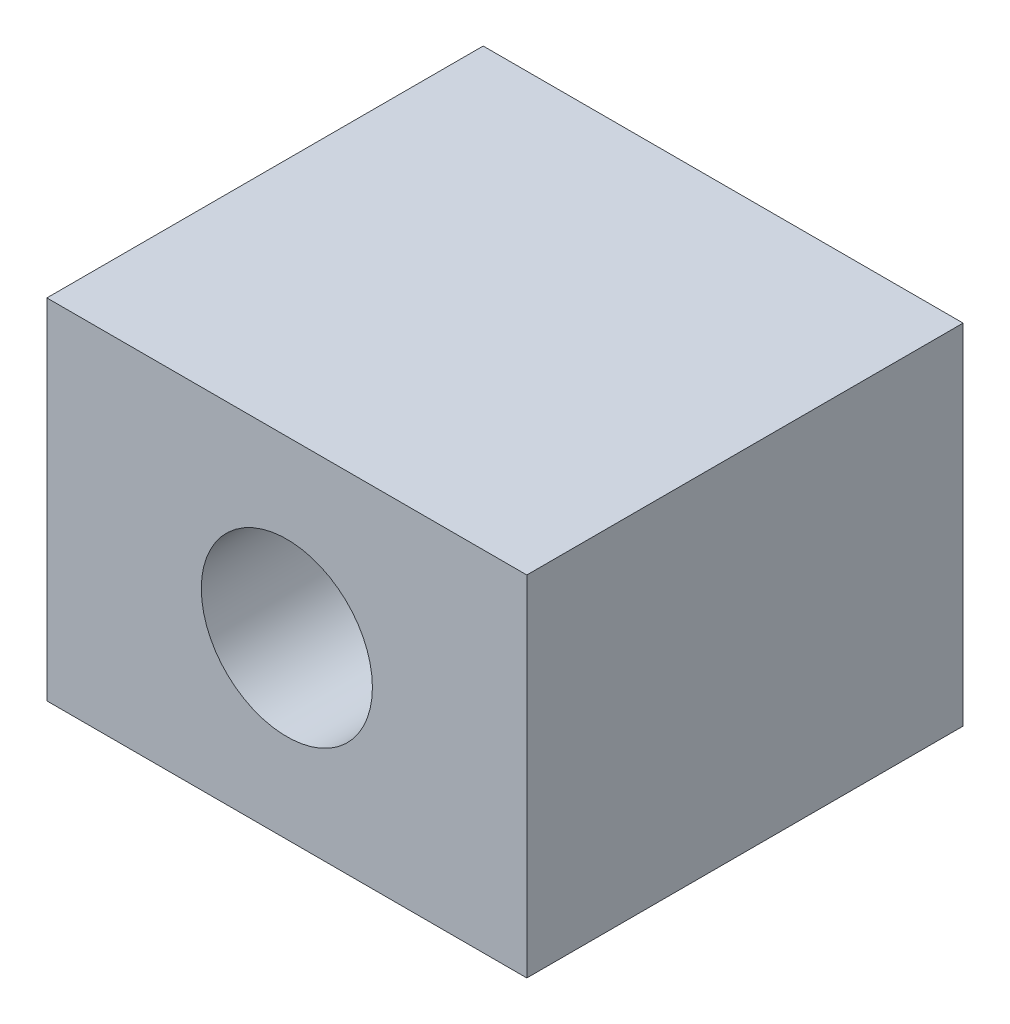
ISO-10303-21;
HEADER;
FILE_DESCRIPTION(('STEP AP214'),'2;1');
FILE_NAME('part.step','',(''),(''),'','','');
FILE_SCHEMA(('AUTOMOTIVE_DESIGN { 1 0 10303 214 1 1 1 1 }'));
ENDSEC;
DATA;
#1=APPLICATION_CONTEXT('core data for automotive mechanical design processes');
#2=APPLICATION_PROTOCOL_DEFINITION('international standard','automotive_design',2000,#1);
#3=PRODUCT_CONTEXT('',#1,'mechanical');
#4=PRODUCT('Part','Part','',(#3));
#5=PRODUCT_RELATED_PRODUCT_CATEGORY('part','',(#4));
#6=PRODUCT_DEFINITION_FORMATION('','',#4);
#7=PRODUCT_DEFINITION_CONTEXT('part definition',#1,'design');
#8=PRODUCT_DEFINITION('design','',#6,#7);
#9=PRODUCT_DEFINITION_SHAPE('','',#8);
#10=(LENGTH_UNIT() NAMED_UNIT(*) SI_UNIT(.MILLI.,.METRE.));
#11=(NAMED_UNIT(*) PLANE_ANGLE_UNIT() SI_UNIT($,.RADIAN.));
#12=(NAMED_UNIT(*) SI_UNIT($,.STERADIAN.) SOLID_ANGLE_UNIT());
#13=UNCERTAINTY_MEASURE_WITH_UNIT(LENGTH_MEASURE(1.E-05),#10,'distance_accuracy_value','');
#14=(GEOMETRIC_REPRESENTATION_CONTEXT(3) GLOBAL_UNCERTAINTY_ASSIGNED_CONTEXT((#13)) GLOBAL_UNIT_ASSIGNED_CONTEXT((#10,
#11,#12)) REPRESENTATION_CONTEXT('',''));
#15=CARTESIAN_POINT('',(0.,0.,0.));
#16=DIRECTION('',(0.,0.,1.));
#17=DIRECTION('',(1.,0.,0.));
#18=AXIS2_PLACEMENT_3D('',#15,#16,#17);
#19=CARTESIAN_POINT('',(0.,0.,50.));
#20=DIRECTION('',(1.,0.,0.));
#21=DIRECTION('',(0.,0.,-1.));
#22=AXIS2_PLACEMENT_3D('',#19,#20,#21);
#23=PLANE('',#22);
#24=DIRECTION('',(0.,-1.,0.));
#25=VECTOR('',#24,1.);
#26=CARTESIAN_POINT('',(0.,0.,0.));
#27=LINE('',#26,#25);
#28=CARTESIAN_POINT('',(0.,40.,0.));
#29=VERTEX_POINT('',#28);
#30=CARTESIAN_POINT('',(0.,0.,0.));
#31=VERTEX_POINT('',#30);
#32=EDGE_CURVE('E98',#29,#31,#27,.T.);
#33=ORIENTED_EDGE('',*,*,#32,.T.);
#34=DIRECTION('',(0.,0.,-1.));
#35=VECTOR('',#34,1.);
#36=CARTESIAN_POINT('',(0.,0.,50.));
#37=LINE('',#36,#35);
#38=CARTESIAN_POINT('',(0.,0.,50.));
#39=VERTEX_POINT('',#38);
#40=EDGE_CURVE('E11',#39,#31,#37,.T.);
#41=ORIENTED_EDGE('',*,*,#40,.F.);
#42=DIRECTION('',(0.,-1.,0.));
#43=VECTOR('',#42,1.);
#44=CARTESIAN_POINT('',(0.,0.,50.));
#45=LINE('',#44,#43);
#46=CARTESIAN_POINT('',(0.,40.,50.));
#47=VERTEX_POINT('',#46);
#48=EDGE_CURVE('E85',#47,#39,#45,.T.);
#49=ORIENTED_EDGE('',*,*,#48,.F.);
#50=DIRECTION('',(0.,0.,-1.));
#51=VECTOR('',#50,1.);
#52=CARTESIAN_POINT('',(0.,40.,50.));
#53=LINE('',#52,#51);
#54=EDGE_CURVE('E94',#47,#29,#53,.T.);
#55=ORIENTED_EDGE('',*,*,#54,.T.);
#56=EDGE_LOOP('',(#33,#41,#49,#55));
#57=FACE_BOUND('',#56,.T.);
#58=ADVANCED_FACE('F33',(#57),#23,.F.);
#59=CARTESIAN_POINT('',(0.,0.,50.));
#60=DIRECTION('',(0.,1.,0.));
#61=DIRECTION('',(0.,0.,1.));
#62=AXIS2_PLACEMENT_3D('',#59,#60,#61);
#63=PLANE('',#62);
#64=DIRECTION('',(1.,0.,0.));
#65=VECTOR('',#64,1.);
#66=CARTESIAN_POINT('',(0.,0.,0.));
#67=LINE('',#66,#65);
#68=CARTESIAN_POINT('',(55.,0.,0.));
#69=VERTEX_POINT('',#68);
#70=EDGE_CURVE('E89',#31,#69,#67,.T.);
#71=ORIENTED_EDGE('',*,*,#70,.T.);
#72=DIRECTION('',(0.,0.,-1.));
#73=VECTOR('',#72,1.);
#74=CARTESIAN_POINT('',(55.,0.,50.));
#75=LINE('',#74,#73);
#76=CARTESIAN_POINT('',(55.,0.,50.));
#77=VERTEX_POINT('',#76);
#78=EDGE_CURVE('E42',#77,#69,#75,.T.);
#79=ORIENTED_EDGE('',*,*,#78,.F.);
#80=DIRECTION('',(1.,0.,0.));
#81=VECTOR('',#80,1.);
#82=CARTESIAN_POINT('',(0.,0.,50.));
#83=LINE('',#82,#81);
#84=EDGE_CURVE('E80',#39,#77,#83,.T.);
#85=ORIENTED_EDGE('',*,*,#84,.F.);
#86=ORIENTED_EDGE('',*,*,#40,.T.);
#87=EDGE_LOOP('',(#71,#79,#85,#86));
#88=FACE_BOUND('',#87,.T.);
#89=ADVANCED_FACE('F88',(#88),#63,.F.);
#90=CARTESIAN_POINT('',(55.,0.,50.));
#91=DIRECTION('',(-1.,0.,0.));
#92=DIRECTION('',(0.,0.,1.));
#93=AXIS2_PLACEMENT_3D('',#90,#91,#92);
#94=PLANE('',#93);
#95=DIRECTION('',(0.,1.,0.));
#96=VECTOR('',#95,1.);
#97=CARTESIAN_POINT('',(55.,0.,0.));
#98=LINE('',#97,#96);
#99=CARTESIAN_POINT('',(55.,40.,0.));
#100=VERTEX_POINT('',#99);
#101=EDGE_CURVE('E67',#69,#100,#98,.T.);
#102=ORIENTED_EDGE('',*,*,#101,.T.);
#103=DIRECTION('',(0.,0.,-1.));
#104=VECTOR('',#103,1.);
#105=CARTESIAN_POINT('',(55.,40.,50.));
#106=LINE('',#105,#104);
#107=CARTESIAN_POINT('',(55.,40.,50.));
#108=VERTEX_POINT('',#107);
#109=EDGE_CURVE('E90',#108,#100,#106,.T.);
#110=ORIENTED_EDGE('',*,*,#109,.F.);
#111=DIRECTION('',(0.,1.,0.));
#112=VECTOR('',#111,1.);
#113=CARTESIAN_POINT('',(55.,0.,50.));
#114=LINE('',#113,#112);
#115=EDGE_CURVE('E83',#77,#108,#114,.T.);
#116=ORIENTED_EDGE('',*,*,#115,.F.);
#117=ORIENTED_EDGE('',*,*,#78,.T.);
#118=EDGE_LOOP('',(#102,#110,#116,#117));
#119=FACE_BOUND('',#118,.T.);
#120=ADVANCED_FACE('F92',(#119),#94,.F.);
#121=CARTESIAN_POINT('',(0.,40.,50.));
#122=DIRECTION('',(0.,-1.,0.));
#123=DIRECTION('',(0.,0.,-1.));
#124=AXIS2_PLACEMENT_3D('',#121,#122,#123);
#125=PLANE('',#124);
#126=DIRECTION('',(-1.,0.,0.));
#127=VECTOR('',#126,1.);
#128=CARTESIAN_POINT('',(0.,40.,0.));
#129=LINE('',#128,#127);
#130=EDGE_CURVE('E73',#100,#29,#129,.T.);
#131=ORIENTED_EDGE('',*,*,#130,.T.);
#132=ORIENTED_EDGE('',*,*,#54,.F.);
#133=DIRECTION('',(-1.,0.,0.));
#134=VECTOR('',#133,1.);
#135=CARTESIAN_POINT('',(0.,40.,50.));
#136=LINE('',#135,#134);
#137=EDGE_CURVE('E50',#108,#47,#136,.T.);
#138=ORIENTED_EDGE('',*,*,#137,.F.);
#139=ORIENTED_EDGE('',*,*,#109,.T.);
#140=EDGE_LOOP('',(#131,#132,#138,#139));
#141=FACE_BOUND('',#140,.T.);
#142=ADVANCED_FACE('F105',(#141),#125,.F.);
#143=CARTESIAN_POINT('',(0.,0.,50.));
#144=DIRECTION('',(0.,0.,-1.));
#145=DIRECTION('',(-1.,0.,0.));
#146=AXIS2_PLACEMENT_3D('',#143,#144,#145);
#147=PLANE('',#146);
#148=CARTESIAN_POINT('',(27.5,20.,50.));
#149=DIRECTION('',(0.,0.,1.));
#150=DIRECTION('',(1.,0.,0.));
#151=AXIS2_PLACEMENT_3D('',#148,#149,#150);
#152=CIRCLE('',#151,9.80491965695405);
#153=CARTESIAN_POINT('',(37.304919656954,20.,50.));
#154=VERTEX_POINT('',#153);
#155=EDGE_CURVE('E111',#154,#154,#152,.T.);
#156=ORIENTED_EDGE('',*,*,#155,.F.);
#157=EDGE_LOOP('',(#156));
#158=FACE_BOUND('',#157,.T.);
#159=ORIENTED_EDGE('',*,*,#48,.T.);
#160=ORIENTED_EDGE('',*,*,#84,.T.);
#161=ORIENTED_EDGE('',*,*,#115,.T.);
#162=ORIENTED_EDGE('',*,*,#137,.T.);
#163=EDGE_LOOP('',(#159,#160,#161,#162));
#164=FACE_BOUND('',#163,.T.);
#165=ADVANCED_FACE('F81',(#158,#164),#147,.F.);
#166=CARTESIAN_POINT('',(0.,0.,0.));
#167=DIRECTION('',(0.,0.,-1.));
#168=DIRECTION('',(-1.,0.,0.));
#169=AXIS2_PLACEMENT_3D('',#166,#167,#168);
#170=PLANE('',#169);
#171=CARTESIAN_POINT('',(27.5,20.,0.));
#172=DIRECTION('',(0.,0.,-1.));
#173=DIRECTION('',(-1.,0.,0.));
#174=AXIS2_PLACEMENT_3D('',#171,#172,#173);
#175=CIRCLE('',#174,9.80491965695405);
#176=CARTESIAN_POINT('',(17.695080343046,20.,0.));
#177=VERTEX_POINT('',#176);
#178=EDGE_CURVE('E36',#177,#177,#175,.T.);
#179=ORIENTED_EDGE('',*,*,#178,.F.);
#180=EDGE_LOOP('',(#179));
#181=FACE_BOUND('',#180,.T.);
#182=ORIENTED_EDGE('',*,*,#32,.F.);
#183=ORIENTED_EDGE('',*,*,#130,.F.);
#184=ORIENTED_EDGE('',*,*,#101,.F.);
#185=ORIENTED_EDGE('',*,*,#70,.F.);
#186=EDGE_LOOP('',(#182,#183,#184,#185));
#187=FACE_BOUND('',#186,.T.);
#188=ADVANCED_FACE('F108',(#181,#187),#170,.T.);
#189=CARTESIAN_POINT('',(27.5,20.,-50.));
#190=DIRECTION('',(0.,0.,1.));
#191=DIRECTION('',(1.,0.,0.));
#192=AXIS2_PLACEMENT_3D('',#189,#190,#191);
#193=CYLINDRICAL_SURFACE('',#192,9.80491965695405);
#194=ORIENTED_EDGE('',*,*,#178,.T.);
#195=EDGE_LOOP('',(#194));
#196=FACE_BOUND('',#195,.T.);
#197=ORIENTED_EDGE('',*,*,#155,.T.);
#198=EDGE_LOOP('',(#197));
#199=FACE_BOUND('',#198,.T.);
#200=ADVANCED_FACE('F118',(#196,#199),#193,.F.);
#201=CLOSED_SHELL('',(#58,#89,#120,#142,#165,#188,#200));
#202=MANIFOLD_SOLID_BREP('B2',#201);
#203=ADVANCED_BREP_SHAPE_REPRESENTATION('',(#18,#202),#14);
#204=SHAPE_DEFINITION_REPRESENTATION(#9,#203);
ENDSEC;
END-ISO-10303-21;
